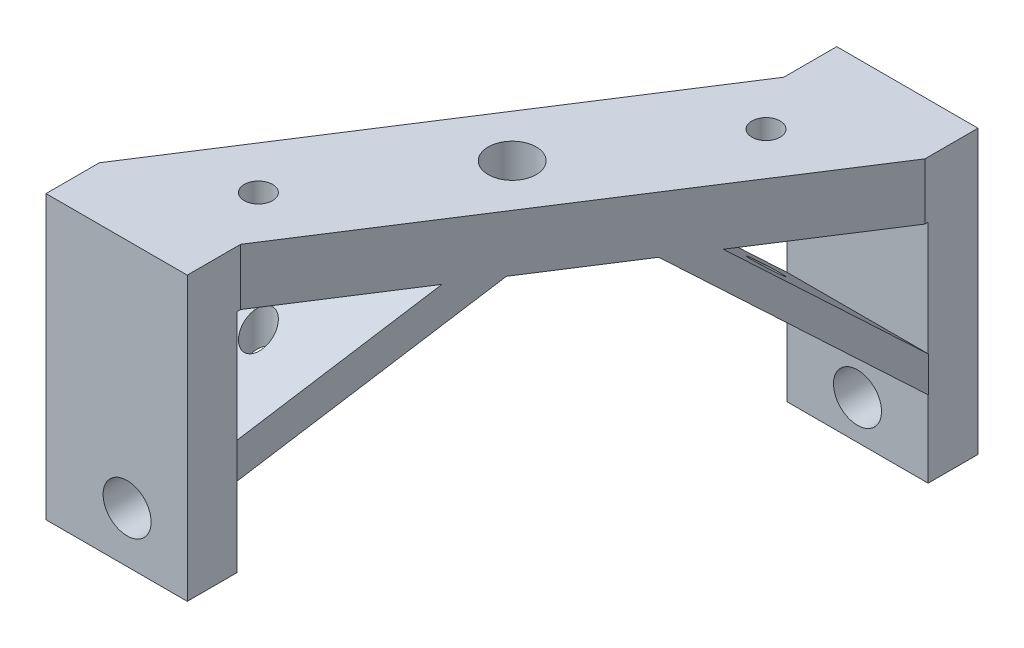
ISO-10303-21;
HEADER;
FILE_DESCRIPTION(('STEP AP214'),'2;1');
FILE_NAME('part.step','',(''),(''),'','','');
FILE_SCHEMA(('AUTOMOTIVE_DESIGN { 1 0 10303 214 1 1 1 1 }'));
ENDSEC;
DATA;
#1=APPLICATION_CONTEXT('core data for automotive mechanical design processes');
#2=APPLICATION_PROTOCOL_DEFINITION('international standard','automotive_design',2000,#1);
#3=PRODUCT_CONTEXT('',#1,'mechanical');
#4=PRODUCT('Part','Part','',(#3));
#5=PRODUCT_RELATED_PRODUCT_CATEGORY('part','',(#4));
#6=PRODUCT_DEFINITION_FORMATION('','',#4);
#7=PRODUCT_DEFINITION_CONTEXT('part definition',#1,'design');
#8=PRODUCT_DEFINITION('design','',#6,#7);
#9=PRODUCT_DEFINITION_SHAPE('','',#8);
#10=(LENGTH_UNIT() NAMED_UNIT(*) SI_UNIT(.MILLI.,.METRE.));
#11=(NAMED_UNIT(*) PLANE_ANGLE_UNIT() SI_UNIT($,.RADIAN.));
#12=(NAMED_UNIT(*) SI_UNIT($,.STERADIAN.) SOLID_ANGLE_UNIT());
#13=UNCERTAINTY_MEASURE_WITH_UNIT(LENGTH_MEASURE(1.E-05),#10,'distance_accuracy_value','');
#14=(GEOMETRIC_REPRESENTATION_CONTEXT(3) GLOBAL_UNCERTAINTY_ASSIGNED_CONTEXT((#13)) GLOBAL_UNIT_ASSIGNED_CONTEXT((#10,
#11,#12)) REPRESENTATION_CONTEXT('',''));
#15=CARTESIAN_POINT('',(0.,0.,0.));
#16=DIRECTION('',(0.,0.,1.));
#17=DIRECTION('',(1.,0.,0.));
#18=AXIS2_PLACEMENT_3D('',#15,#16,#17);
#19=CARTESIAN_POINT('',(-33.05,-4.00000000000001,0.));
#20=DIRECTION('',(0.,1.,0.));
#21=DIRECTION('',(0.,0.,1.));
#22=AXIS2_PLACEMENT_3D('',#19,#20,#21);
#23=PLANE('',#22);
#24=CARTESIAN_POINT('',(7.45330480302373,-4.00000000000001,-3.80222775707192));
#25=DIRECTION('',(0.,1.,0.));
#26=DIRECTION('',(0.,0.,1.));
#27=AXIS2_PLACEMENT_3D('',#24,#25,#26);
#28=CIRCLE('',#27,1.);
#29=CARTESIAN_POINT('',(7.45330480302373,-4.00000000000001,-2.80222775707191));
#30=VERTEX_POINT('',#29);
#31=EDGE_CURVE('E275',#30,#30,#28,.T.);
#32=ORIENTED_EDGE('',*,*,#31,.T.);
#33=EDGE_LOOP('',(#32));
#34=FACE_BOUND('',#33,.T.);
#35=DIRECTION('',(0.541539369461563,0.,-0.840675389983062));
#36=VECTOR('',#35,1.);
#37=CARTESIAN_POINT('',(18.9809548996278,-4.,-29.4656724189063));
#38=LINE('',#37,#36);
#39=CARTESIAN_POINT('',(0.,-4.00000000000001,0.));
#40=VERTEX_POINT('',#39);
#41=CARTESIAN_POINT('',(5.58186834052013,-4.00000000000001,-8.66518596545716));
#42=VERTEX_POINT('',#41);
#43=EDGE_CURVE('E249',#40,#42,#38,.T.);
#44=ORIENTED_EDGE('',*,*,#43,.T.);
#45=DIRECTION('',(-1.,0.,0.));
#46=VECTOR('',#45,1.);
#47=CARTESIAN_POINT('',(34.5923992558109,-4.00000000000001,-8.66518596545717));
#48=LINE('',#47,#46);
#49=CARTESIAN_POINT('',(15.5818683405201,-4.00000000000001,-8.66518596545717));
#50=VERTEX_POINT('',#49);
#51=EDGE_CURVE('E310',#50,#42,#48,.T.);
#52=ORIENTED_EDGE('',*,*,#51,.F.);
#53=DIRECTION('',(-0.541539369461563,0.,0.840675389983061));
#54=VECTOR('',#53,1.);
#55=CARTESIAN_POINT('',(10.,-4.00000000000001,0.));
#56=LINE('',#55,#54);
#57=CARTESIAN_POINT('',(10.,-4.,0.));
#58=VERTEX_POINT('',#57);
#59=EDGE_CURVE('E248',#50,#58,#56,.T.);
#60=ORIENTED_EDGE('',*,*,#59,.T.);
#61=DIRECTION('',(0.,0.,-1.));
#62=VECTOR('',#61,1.);
#63=CARTESIAN_POINT('',(10.,-4.,4.));
#64=LINE('',#63,#62);
#65=CARTESIAN_POINT('',(10.,-4.00000000000001,0.25));
#66=VERTEX_POINT('',#65);
#67=EDGE_CURVE('E225',#66,#58,#64,.T.);
#68=ORIENTED_EDGE('',*,*,#67,.F.);
#69=DIRECTION('',(1.,0.,0.));
#70=VECTOR('',#69,1.);
#71=CARTESIAN_POINT('',(0.,-4.00000000000001,0.25));
#72=LINE('',#71,#70);
#73=CARTESIAN_POINT('',(0.,-4.00000000000001,0.25));
#74=VERTEX_POINT('',#73);
#75=EDGE_CURVE('E207',#74,#66,#72,.T.);
#76=ORIENTED_EDGE('',*,*,#75,.F.);
#77=DIRECTION('',(0.,0.,-1.));
#78=VECTOR('',#77,1.);
#79=CARTESIAN_POINT('',(0.,-4.00000000000001,4.));
#80=LINE('',#79,#78);
#81=EDGE_CURVE('E228',#74,#40,#80,.T.);
#82=ORIENTED_EDGE('',*,*,#81,.T.);
#83=EDGE_LOOP('',(#44,#52,#60,#68,#76,#82));
#84=FACE_BOUND('',#83,.T.);
#85=ADVANCED_FACE('F34',(#34,#84),#23,.F.);
#86=CARTESIAN_POINT('',(14.4904774498139,-4.,-14.7328362094532));
#87=DIRECTION('',(0.,1.,0.));
#88=DIRECTION('',(0.,0.,1.));
#89=AXIS2_PLACEMENT_3D('',#86,#87,#88);
#90=CIRCLE('',#89,1.7);
#91=CARTESIAN_POINT('',(14.4904774498139,-4.,-13.0328362094532));
#92=VERTEX_POINT('',#91);
#93=EDGE_CURVE('E243',#92,#92,#90,.T.);
#94=ORIENTED_EDGE('',*,*,#93,.T.);
#95=EDGE_LOOP('',(#94));
#96=FACE_BOUND('',#95,.T.);
#97=CARTESIAN_POINT('',(21.5964039513119,-4.,-18.0020363503085));
#98=VERTEX_POINT('',#97);
#99=CARTESIAN_POINT('',(17.3708931836974,-4.00000000000001,-11.4424340152579));
#100=VERTEX_POINT('',#99);
#101=EDGE_CURVE('E247',#98,#100,#56,.T.);
#102=ORIENTED_EDGE('',*,*,#101,.T.);
#103=DIRECTION('',(-1.,0.,0.));
#104=VECTOR('',#103,1.);
#105=CARTESIAN_POINT('',(36.3814240989882,-4.,-11.4424340152579));
#106=LINE('',#105,#104);
#107=CARTESIAN_POINT('',(7.37089318369744,-4.00000000000001,-11.4424340152579));
#108=VERTEX_POINT('',#107);
#109=EDGE_CURVE('E319',#100,#108,#106,.T.);
#110=ORIENTED_EDGE('',*,*,#109,.T.);
#111=CARTESIAN_POINT('',(11.5964039513119,-4.,-18.0020363503085));
#112=VERTEX_POINT('',#111);
#113=EDGE_CURVE('E252',#108,#112,#38,.T.);
#114=ORIENTED_EDGE('',*,*,#113,.T.);
#115=DIRECTION('',(-1.,0.,0.));
#116=VECTOR('',#115,1.);
#117=CARTESIAN_POINT('',(40.6069348666027,-4.,-18.0020363503085));
#118=LINE('',#117,#116);
#119=EDGE_CURVE('E337',#98,#112,#118,.T.);
#120=ORIENTED_EDGE('',*,*,#119,.F.);
#121=EDGE_LOOP('',(#102,#110,#114,#120));
#122=FACE_BOUND('',#121,.T.);
#123=ADVANCED_FACE('F413',(#96,#122),#23,.F.);
#124=CARTESIAN_POINT('',(21.5333279339781,-4.,-25.6597871591787));
#125=DIRECTION('',(0.,1.,0.));
#126=DIRECTION('',(0.,0.,1.));
#127=AXIS2_PLACEMENT_3D('',#124,#125,#126);
#128=CIRCLE('',#127,1.);
#129=CARTESIAN_POINT('',(21.5333279339781,-4.,-24.6597871591787));
#130=VERTEX_POINT('',#129);
#131=EDGE_CURVE('E292',#130,#130,#128,.T.);
#132=ORIENTED_EDGE('',*,*,#131,.T.);
#133=EDGE_LOOP('',(#132));
#134=FACE_BOUND('',#133,.T.);
#135=CARTESIAN_POINT('',(28.9809548996278,-4.,-29.4656724189063));
#136=VERTEX_POINT('',#135);
#137=CARTESIAN_POINT('',(23.3854287944892,-4.,-20.7792844001093));
#138=VERTEX_POINT('',#137);
#139=EDGE_CURVE('E244',#136,#138,#56,.T.);
#140=ORIENTED_EDGE('',*,*,#139,.T.);
#141=DIRECTION('',(-1.,0.,0.));
#142=VECTOR('',#141,1.);
#143=CARTESIAN_POINT('',(42.3959597097801,-4.,-20.7792844001093));
#144=LINE('',#143,#142);
#145=CARTESIAN_POINT('',(13.3854287944892,-4.,-20.7792844001093));
#146=VERTEX_POINT('',#145);
#147=EDGE_CURVE('E345',#138,#146,#144,.T.);
#148=ORIENTED_EDGE('',*,*,#147,.T.);
#149=CARTESIAN_POINT('',(18.9809548996278,-4.,-29.4656724189063));
#150=VERTEX_POINT('',#149);
#151=EDGE_CURVE('E246',#146,#150,#38,.T.);
#152=ORIENTED_EDGE('',*,*,#151,.T.);
#153=DIRECTION('',(0.,0.,1.));
#154=VECTOR('',#153,1.);
#155=CARTESIAN_POINT('',(18.9809548996278,-4.,-33.4656724189063));
#156=LINE('',#155,#154);
#157=CARTESIAN_POINT('',(18.9809548996278,-4.,-29.6856724189063));
#158=VERTEX_POINT('',#157);
#159=EDGE_CURVE('E237',#158,#150,#156,.T.);
#160=ORIENTED_EDGE('',*,*,#159,.F.);
#161=DIRECTION('',(-1.,0.,0.));
#162=VECTOR('',#161,1.);
#163=CARTESIAN_POINT('',(18.9809548996278,-4.,-29.6856724189063));
#164=LINE('',#163,#162);
#165=CARTESIAN_POINT('',(28.9809548996278,-4.,-29.6856724189063));
#166=VERTEX_POINT('',#165);
#167=EDGE_CURVE('E194',#166,#158,#164,.T.);
#168=ORIENTED_EDGE('',*,*,#167,.F.);
#169=DIRECTION('',(0.,0.,1.));
#170=VECTOR('',#169,1.);
#171=CARTESIAN_POINT('',(28.9809548996278,-4.,-33.4656724189063));
#172=LINE('',#171,#170);
#173=EDGE_CURVE('E232',#166,#136,#172,.T.);
#174=ORIENTED_EDGE('',*,*,#173,.T.);
#175=EDGE_LOOP('',(#140,#148,#152,#160,#168,#174));
#176=FACE_BOUND('',#175,.T.);
#177=ADVANCED_FACE('F416',(#134,#176),#23,.F.);
#178=CARTESIAN_POINT('',(18.9809548996278,0.,-29.4656724189063));
#179=DIRECTION('',(-0.840675389983061,0.,-0.541539369461563));
#180=DIRECTION('',(-0.541539369461563,0.,0.840675389983062));
#181=AXIS2_PLACEMENT_3D('',#178,#179,#180);
#182=PLANE('',#181);
#183=ORIENTED_EDGE('',*,*,#43,.F.);
#184=DIRECTION('',(0.,-1.,0.));
#185=VECTOR('',#184,1.);
#186=CARTESIAN_POINT('',(0.,0.,0.));
#187=LINE('',#186,#185);
#188=CARTESIAN_POINT('',(0.,0.,0.));
#189=VERTEX_POINT('',#188);
#190=EDGE_CURVE('E251',#189,#40,#187,.T.);
#191=ORIENTED_EDGE('',*,*,#190,.F.);
#192=DIRECTION('',(-0.541539369461563,0.,0.840675389983061));
#193=VECTOR('',#192,1.);
#194=CARTESIAN_POINT('',(18.9809548996278,0.,-29.4656724189063));
#195=LINE('',#194,#193);
#196=CARTESIAN_POINT('',(18.9809548996278,0.,-29.4656724189063));
#197=VERTEX_POINT('',#196);
#198=EDGE_CURVE('E11',#197,#189,#195,.T.);
#199=ORIENTED_EDGE('',*,*,#198,.F.);
#200=DIRECTION('',(0.,-1.,0.));
#201=VECTOR('',#200,1.);
#202=CARTESIAN_POINT('',(18.9809548996278,0.,-29.4656724189063));
#203=LINE('',#202,#201);
#204=EDGE_CURVE('E253',#197,#150,#203,.T.);
#205=ORIENTED_EDGE('',*,*,#204,.T.);
#206=ORIENTED_EDGE('',*,*,#151,.F.);
#207=DIRECTION('',(0.431022047705189,-0.605401732152346,-0.669110407256504));
#208=VECTOR('',#207,1.);
#209=CARTESIAN_POINT('',(19.0811118401627,-12.,-29.6211541433974));
#210=LINE('',#209,#208);
#211=CARTESIAN_POINT('',(19.0811118401627,-12.,-29.6211541433974));
#212=VERTEX_POINT('',#211);
#213=EDGE_CURVE('E326',#146,#212,#210,.T.);
#214=ORIENTED_EDGE('',*,*,#213,.T.);
#215=DIRECTION('',(0.,-1.,0.));
#216=VECTOR('',#215,1.);
#217=CARTESIAN_POINT('',(19.0811118401627,-14.5128151673205,-29.6211541433974));
#218=LINE('',#217,#216);
#219=CARTESIAN_POINT('',(19.0811118401627,-14.5128151673205,-29.6211541433974));
#220=VERTEX_POINT('',#219);
#221=EDGE_CURVE('E325',#212,#220,#218,.T.);
#222=ORIENTED_EDGE('',*,*,#221,.T.);
#223=DIRECTION('',(-0.431022047705189,0.605401732152346,0.669110407256504));
#224=VECTOR('',#223,1.);
#225=CARTESIAN_POINT('',(11.5964039513119,-4.,-18.0020363503085));
#226=LINE('',#225,#224);
#227=EDGE_CURVE('E330',#220,#112,#226,.T.);
#228=ORIENTED_EDGE('',*,*,#227,.T.);
#229=ORIENTED_EDGE('',*,*,#113,.F.);
#230=DIRECTION('',(-0.431022047705186,-0.605401732152352,0.669110407256501));
#231=VECTOR('',#230,1.);
#232=CARTESIAN_POINT('',(7.37089318369744,-4.,-11.4424340152579));
#233=LINE('',#232,#231);
#234=CARTESIAN_POINT('',(-0.113814705153315,-14.5128151673205,0.176683777830793));
#235=VERTEX_POINT('',#234);
#236=EDGE_CURVE('E299',#108,#235,#233,.T.);
#237=ORIENTED_EDGE('',*,*,#236,.T.);
#238=DIRECTION('',(0.,1.,0.));
#239=VECTOR('',#238,1.);
#240=CARTESIAN_POINT('',(-0.113814705153315,-14.5128151673205,0.176683777830793));
#241=LINE('',#240,#239);
#242=CARTESIAN_POINT('',(-0.113814705153316,-12.,0.176683777830793));
#243=VERTEX_POINT('',#242);
#244=EDGE_CURVE('E298',#235,#243,#241,.T.);
#245=ORIENTED_EDGE('',*,*,#244,.T.);
#246=DIRECTION('',(0.431022047705186,0.605401732152352,-0.669110407256501));
#247=VECTOR('',#246,1.);
#248=CARTESIAN_POINT('',(-0.113814705153316,-12.,0.176683777830793));
#249=LINE('',#248,#247);
#250=EDGE_CURVE('E303',#243,#42,#249,.T.);
#251=ORIENTED_EDGE('',*,*,#250,.T.);
#252=EDGE_LOOP('',(#183,#191,#199,#205,#206,#214,#222,#228,#229,#237,#245,#251));
#253=FACE_BOUND('',#252,.T.);
#254=ADVANCED_FACE('F36',(#253),#182,.T.);
#255=CARTESIAN_POINT('',(18.9809548996278,0.,-29.4656724189063));
#256=DIRECTION('',(0.,1.,0.));
#257=DIRECTION('',(0.,0.,1.));
#258=AXIS2_PLACEMENT_3D('',#255,#256,#257);
#259=PLANE('',#258);
#260=DIRECTION('',(1.,0.,0.));
#261=VECTOR('',#260,1.);
#262=CARTESIAN_POINT('',(18.9809548996278,0.,-33.2156724189063));
#263=LINE('',#262,#261);
#264=CARTESIAN_POINT('',(18.9809548996278,0.,-33.2156724189063));
#265=VERTEX_POINT('',#264);
#266=CARTESIAN_POINT('',(28.9809548996278,0.,-33.2156724189063));
#267=VERTEX_POINT('',#266);
#268=EDGE_CURVE('E426',#265,#267,#263,.T.);
#269=ORIENTED_EDGE('',*,*,#268,.F.);
#270=DIRECTION('',(0.,0.,1.));
#271=VECTOR('',#270,1.);
#272=CARTESIAN_POINT('',(18.9809548996278,0.,-33.4656724189063));
#273=LINE('',#272,#271);
#274=EDGE_CURVE('E187',#265,#197,#273,.T.);
#275=ORIENTED_EDGE('',*,*,#274,.T.);
#276=ORIENTED_EDGE('',*,*,#198,.T.);
#277=DIRECTION('',(0.,0.,-1.));
#278=VECTOR('',#277,1.);
#279=CARTESIAN_POINT('',(0.,0.,4.));
#280=LINE('',#279,#278);
#281=CARTESIAN_POINT('',(0.,0.,3.78));
#282=VERTEX_POINT('',#281);
#283=EDGE_CURVE('E230',#282,#189,#280,.T.);
#284=ORIENTED_EDGE('',*,*,#283,.F.);
#285=DIRECTION('',(-1.,0.,0.));
#286=VECTOR('',#285,1.);
#287=CARTESIAN_POINT('',(18.9809548996278,0.,3.78));
#288=LINE('',#287,#286);
#289=CARTESIAN_POINT('',(10.,0.,3.78));
#290=VERTEX_POINT('',#289);
#291=EDGE_CURVE('E271',#290,#282,#288,.T.);
#292=ORIENTED_EDGE('',*,*,#291,.F.);
#293=DIRECTION('',(0.,0.,-1.));
#294=VECTOR('',#293,1.);
#295=CARTESIAN_POINT('',(10.,0.,4.));
#296=LINE('',#295,#294);
#297=CARTESIAN_POINT('',(10.,0.,0.));
#298=VERTEX_POINT('',#297);
#299=EDGE_CURVE('E223',#290,#298,#296,.T.);
#300=ORIENTED_EDGE('',*,*,#299,.T.);
#301=DIRECTION('',(-0.541539369461563,0.,0.840675389983061));
#302=VECTOR('',#301,1.);
#303=CARTESIAN_POINT('',(28.9809548996278,0.,-29.4656724189063));
#304=LINE('',#303,#302);
#305=CARTESIAN_POINT('',(28.9809548996278,0.,-29.4656724189063));
#306=VERTEX_POINT('',#305);
#307=EDGE_CURVE('E43',#306,#298,#304,.T.);
#308=ORIENTED_EDGE('',*,*,#307,.F.);
#309=DIRECTION('',(0.,0.,1.));
#310=VECTOR('',#309,1.);
#311=CARTESIAN_POINT('',(28.9809548996278,0.,-33.4656724189063));
#312=LINE('',#311,#310);
#313=EDGE_CURVE('E234',#267,#306,#312,.T.);
#314=ORIENTED_EDGE('',*,*,#313,.F.);
#315=EDGE_LOOP('',(#269,#275,#276,#284,#292,#300,#308,#314));
#316=FACE_BOUND('',#315,.T.);
#317=CARTESIAN_POINT('',(7.45330480302373,0.,-3.80222775707192));
#318=DIRECTION('',(0.,1.,0.));
#319=DIRECTION('',(0.,0.,1.));
#320=AXIS2_PLACEMENT_3D('',#317,#318,#319);
#321=CIRCLE('',#320,1.);
#322=CARTESIAN_POINT('',(7.45330480302373,0.,-2.80222775707191));
#323=VERTEX_POINT('',#322);
#324=EDGE_CURVE('E282',#323,#323,#321,.T.);
#325=ORIENTED_EDGE('',*,*,#324,.F.);
#326=EDGE_LOOP('',(#325));
#327=FACE_BOUND('',#326,.T.);
#328=CARTESIAN_POINT('',(21.5333279339781,0.,-25.6597871591787));
#329=DIRECTION('',(0.,1.,0.));
#330=DIRECTION('',(0.,0.,1.));
#331=AXIS2_PLACEMENT_3D('',#328,#329,#330);
#332=CIRCLE('',#331,1.);
#333=CARTESIAN_POINT('',(21.5333279339781,0.,-24.6597871591787));
#334=VERTEX_POINT('',#333);
#335=EDGE_CURVE('E279',#334,#334,#332,.T.);
#336=ORIENTED_EDGE('',*,*,#335,.F.);
#337=EDGE_LOOP('',(#336));
#338=FACE_BOUND('',#337,.T.);
#339=CARTESIAN_POINT('',(14.4904774498139,0.,-14.7328362094532));
#340=DIRECTION('',(0.,1.,0.));
#341=DIRECTION('',(0.,0.,1.));
#342=AXIS2_PLACEMENT_3D('',#339,#340,#341);
#343=CIRCLE('',#342,1.7);
#344=CARTESIAN_POINT('',(14.4904774498139,0.,-13.0328362094532));
#345=VERTEX_POINT('',#344);
#346=EDGE_CURVE('E240',#345,#345,#343,.T.);
#347=ORIENTED_EDGE('',*,*,#346,.F.);
#348=EDGE_LOOP('',(#347));
#349=FACE_BOUND('',#348,.T.);
#350=ADVANCED_FACE('F383',(#316,#327,#338,#349),#259,.T.);
#351=CARTESIAN_POINT('',(28.9809548996278,0.,-29.4656724189063));
#352=DIRECTION('',(0.840675389983061,0.,0.541539369461563));
#353=DIRECTION('',(0.541539369461563,0.,-0.840675389983062));
#354=AXIS2_PLACEMENT_3D('',#351,#352,#353);
#355=PLANE('',#354);
#356=ORIENTED_EDGE('',*,*,#139,.F.);
#357=DIRECTION('',(0.,1.,0.));
#358=VECTOR('',#357,1.);
#359=CARTESIAN_POINT('',(28.9809548996278,0.,-29.4656724189063));
#360=LINE('',#359,#358);
#361=EDGE_CURVE('E256',#136,#306,#360,.T.);
#362=ORIENTED_EDGE('',*,*,#361,.T.);
#363=ORIENTED_EDGE('',*,*,#307,.T.);
#364=DIRECTION('',(0.,1.,0.));
#365=VECTOR('',#364,1.);
#366=CARTESIAN_POINT('',(10.,0.,0.));
#367=LINE('',#366,#365);
#368=EDGE_CURVE('E257',#58,#298,#367,.T.);
#369=ORIENTED_EDGE('',*,*,#368,.F.);
#370=ORIENTED_EDGE('',*,*,#59,.F.);
#371=DIRECTION('',(0.431022047705186,0.605401732152352,-0.669110407256501));
#372=VECTOR('',#371,1.);
#373=CARTESIAN_POINT('',(13.4179618348999,-7.03936365597305,-5.30597877188253));
#374=LINE('',#373,#372);
#375=CARTESIAN_POINT('',(9.88618529484668,-12.,0.176683777830793));
#376=VERTEX_POINT('',#375);
#377=EDGE_CURVE('E302',#376,#50,#374,.T.);
#378=ORIENTED_EDGE('',*,*,#377,.F.);
#379=DIRECTION('',(0.,1.,0.));
#380=VECTOR('',#379,1.);
#381=CARTESIAN_POINT('',(9.88618529484669,-14.5128151673205,0.176683777830793));
#382=LINE('',#381,#380);
#383=CARTESIAN_POINT('',(9.88618529484668,-14.5128151673205,0.176683777830793));
#384=VERTEX_POINT('',#383);
#385=EDGE_CURVE('E311',#384,#376,#382,.T.);
#386=ORIENTED_EDGE('',*,*,#385,.F.);
#387=DIRECTION('',(-0.431022047705186,-0.605401732152352,0.669110407256501));
#388=VECTOR('',#387,1.);
#389=CARTESIAN_POINT('',(20.9026697237507,0.960636344026954,-16.9250965649713));
#390=LINE('',#389,#388);
#391=EDGE_CURVE('E316',#100,#384,#390,.T.);
#392=ORIENTED_EDGE('',*,*,#391,.F.);
#393=ORIENTED_EDGE('',*,*,#101,.F.);
#394=DIRECTION('',(-0.431022047705189,0.605401732152346,0.669110407256504));
#395=VECTOR('',#394,1.);
#396=CARTESIAN_POINT('',(25.1281804913652,-8.96063634402698,-23.4846989000219));
#397=LINE('',#396,#395);
#398=CARTESIAN_POINT('',(29.0811118401627,-14.5128151673205,-29.6211541433974));
#399=VERTEX_POINT('',#398);
#400=EDGE_CURVE('E329',#399,#98,#397,.T.);
#401=ORIENTED_EDGE('',*,*,#400,.F.);
#402=DIRECTION('',(0.,-1.,0.));
#403=VECTOR('',#402,1.);
#404=CARTESIAN_POINT('',(29.0811118401627,-14.5128151673205,-29.6211541433974));
#405=LINE('',#404,#403);
#406=CARTESIAN_POINT('',(29.0811118401627,-12.,-29.6211541433974));
#407=VERTEX_POINT('',#406);
#408=EDGE_CURVE('E338',#407,#399,#405,.T.);
#409=ORIENTED_EDGE('',*,*,#408,.F.);
#410=DIRECTION('',(0.431022047705189,-0.605401732152346,-0.669110407256504));
#411=VECTOR('',#410,1.);
#412=CARTESIAN_POINT('',(32.612888380216,-16.960636344027,-35.1038166931108));
#413=LINE('',#412,#411);
#414=EDGE_CURVE('E342',#138,#407,#413,.T.);
#415=ORIENTED_EDGE('',*,*,#414,.F.);
#416=EDGE_LOOP('',(#356,#362,#363,#369,#370,#378,#386,#392,#393,#401,#409,#415));
#417=FACE_BOUND('',#416,.T.);
#418=ADVANCED_FACE('F367',(#417),#355,.T.);
#419=CARTESIAN_POINT('',(14.4904774498139,-43.05,-14.7328362094532));
#420=DIRECTION('',(0.,1.,0.));
#421=DIRECTION('',(0.,0.,1.));
#422=AXIS2_PLACEMENT_3D('',#419,#420,#421);
#423=CYLINDRICAL_SURFACE('',#422,1.7);
#424=ORIENTED_EDGE('',*,*,#346,.T.);
#425=EDGE_LOOP('',(#424));
#426=FACE_BOUND('',#425,.T.);
#427=ORIENTED_EDGE('',*,*,#93,.F.);
#428=EDGE_LOOP('',(#427));
#429=FACE_BOUND('',#428,.T.);
#430=ADVANCED_FACE('F537',(#426,#429),#423,.F.);
#431=CARTESIAN_POINT('',(18.9809548996278,-4.,-33.4656724189063));
#432=DIRECTION('',(1.,0.,0.));
#433=DIRECTION('',(0.,1.,0.));
#434=AXIS2_PLACEMENT_3D('',#431,#432,#433);
#435=PLANE('',#434);
#436=ORIENTED_EDGE('',*,*,#274,.F.);
#437=DIRECTION('',(0.,1.,0.));
#438=VECTOR('',#437,1.);
#439=CARTESIAN_POINT('',(18.9809548996278,-20.,-33.2156724189063));
#440=LINE('',#439,#438);
#441=CARTESIAN_POINT('',(18.9809548996278,-20.,-33.2156724189063));
#442=VERTEX_POINT('',#441);
#443=EDGE_CURVE('E174',#442,#265,#440,.T.);
#444=ORIENTED_EDGE('',*,*,#443,.F.);
#445=DIRECTION('',(0.,0.,-1.));
#446=VECTOR('',#445,1.);
#447=CARTESIAN_POINT('',(18.9809548996278,-20.,-33.4656724189063));
#448=LINE('',#447,#446);
#449=CARTESIAN_POINT('',(18.9809548996278,-20.,-29.6856724189063));
#450=VERTEX_POINT('',#449);
#451=EDGE_CURVE('E185',#450,#442,#448,.T.);
#452=ORIENTED_EDGE('',*,*,#451,.F.);
#453=DIRECTION('',(0.,1.,0.));
#454=VECTOR('',#453,1.);
#455=CARTESIAN_POINT('',(18.9809548996278,-20.,-29.6856724189063));
#456=LINE('',#455,#454);
#457=EDGE_CURVE('E202',#450,#158,#456,.T.);
#458=ORIENTED_EDGE('',*,*,#457,.T.);
#459=ORIENTED_EDGE('',*,*,#159,.T.);
#460=ORIENTED_EDGE('',*,*,#204,.F.);
#461=EDGE_LOOP('',(#436,#444,#452,#458,#459,#460));
#462=FACE_BOUND('',#461,.T.);
#463=ADVANCED_FACE('F183',(#462),#435,.F.);
#464=CARTESIAN_POINT('',(28.9809548996278,0.,-33.4656724189063));
#465=DIRECTION('',(-1.,0.,0.));
#466=DIRECTION('',(0.,-1.,0.));
#467=AXIS2_PLACEMENT_3D('',#464,#465,#466);
#468=PLANE('',#467);
#469=DIRECTION('',(0.,0.,1.));
#470=VECTOR('',#469,1.);
#471=CARTESIAN_POINT('',(28.9809548996278,-20.,-33.4656724189063));
#472=LINE('',#471,#470);
#473=CARTESIAN_POINT('',(28.9809548996278,-20.,-33.2156724189063));
#474=VERTEX_POINT('',#473);
#475=CARTESIAN_POINT('',(28.9809548996278,-20.,-29.6856724189063));
#476=VERTEX_POINT('',#475);
#477=EDGE_CURVE('E193',#474,#476,#472,.T.);
#478=ORIENTED_EDGE('',*,*,#477,.F.);
#479=DIRECTION('',(0.,1.,0.));
#480=VECTOR('',#479,1.);
#481=CARTESIAN_POINT('',(28.9809548996278,-20.,-33.2156724189063));
#482=LINE('',#481,#480);
#483=EDGE_CURVE('E59',#474,#267,#482,.T.);
#484=ORIENTED_EDGE('',*,*,#483,.T.);
#485=ORIENTED_EDGE('',*,*,#313,.T.);
#486=ORIENTED_EDGE('',*,*,#361,.F.);
#487=ORIENTED_EDGE('',*,*,#173,.F.);
#488=DIRECTION('',(0.,1.,0.));
#489=VECTOR('',#488,1.);
#490=CARTESIAN_POINT('',(28.9809548996278,-20.,-29.6856724189063));
#491=LINE('',#490,#489);
#492=EDGE_CURVE('E205',#476,#166,#491,.T.);
#493=ORIENTED_EDGE('',*,*,#492,.F.);
#494=EDGE_LOOP('',(#478,#484,#485,#486,#487,#493));
#495=FACE_BOUND('',#494,.T.);
#496=ADVANCED_FACE('F423',(#495),#468,.F.);
#497=CARTESIAN_POINT('',(0.,0.,4.));
#498=DIRECTION('',(1.,0.,0.));
#499=DIRECTION('',(0.,0.,-1.));
#500=AXIS2_PLACEMENT_3D('',#497,#498,#499);
#501=PLANE('',#500);
#502=DIRECTION('',(0.,0.,-1.));
#503=VECTOR('',#502,1.);
#504=CARTESIAN_POINT('',(0.,-20.,4.));
#505=LINE('',#504,#503);
#506=CARTESIAN_POINT('',(0.,-20.,3.78));
#507=VERTEX_POINT('',#506);
#508=CARTESIAN_POINT('',(0.,-20.,0.249999999999996));
#509=VERTEX_POINT('',#508);
#510=EDGE_CURVE('E208',#507,#509,#505,.T.);
#511=ORIENTED_EDGE('',*,*,#510,.F.);
#512=DIRECTION('',(0.,1.,0.));
#513=VECTOR('',#512,1.);
#514=CARTESIAN_POINT('',(0.,-20.,3.78));
#515=LINE('',#514,#513);
#516=EDGE_CURVE('E51',#507,#282,#515,.T.);
#517=ORIENTED_EDGE('',*,*,#516,.T.);
#518=ORIENTED_EDGE('',*,*,#283,.T.);
#519=ORIENTED_EDGE('',*,*,#190,.T.);
#520=ORIENTED_EDGE('',*,*,#81,.F.);
#521=DIRECTION('',(0.,1.,0.));
#522=VECTOR('',#521,1.);
#523=CARTESIAN_POINT('',(0.,-20.,0.249999999999996));
#524=LINE('',#523,#522);
#525=EDGE_CURVE('E220',#509,#74,#524,.T.);
#526=ORIENTED_EDGE('',*,*,#525,.F.);
#527=EDGE_LOOP('',(#511,#517,#518,#519,#520,#526));
#528=FACE_BOUND('',#527,.T.);
#529=ADVANCED_FACE('F400',(#528),#501,.F.);
#530=CARTESIAN_POINT('',(10.,-4.,4.));
#531=DIRECTION('',(-1.,0.,0.));
#532=DIRECTION('',(0.,-1.,0.));
#533=AXIS2_PLACEMENT_3D('',#530,#531,#532);
#534=PLANE('',#533);
#535=ORIENTED_EDGE('',*,*,#299,.F.);
#536=DIRECTION('',(0.,1.,0.));
#537=VECTOR('',#536,1.);
#538=CARTESIAN_POINT('',(10.,-20.,3.78));
#539=LINE('',#538,#537);
#540=CARTESIAN_POINT('',(10.,-20.,3.78));
#541=VERTEX_POINT('',#540);
#542=EDGE_CURVE('E388',#541,#290,#539,.T.);
#543=ORIENTED_EDGE('',*,*,#542,.F.);
#544=DIRECTION('',(0.,0.,1.));
#545=VECTOR('',#544,1.);
#546=CARTESIAN_POINT('',(10.,-20.,4.));
#547=LINE('',#546,#545);
#548=CARTESIAN_POINT('',(10.,-20.,0.249999999999996));
#549=VERTEX_POINT('',#548);
#550=EDGE_CURVE('E212',#549,#541,#547,.T.);
#551=ORIENTED_EDGE('',*,*,#550,.F.);
#552=DIRECTION('',(0.,1.,0.));
#553=VECTOR('',#552,1.);
#554=CARTESIAN_POINT('',(10.,-20.,0.249999999999996));
#555=LINE('',#554,#553);
#556=EDGE_CURVE('E215',#549,#66,#555,.T.);
#557=ORIENTED_EDGE('',*,*,#556,.T.);
#558=ORIENTED_EDGE('',*,*,#67,.T.);
#559=ORIENTED_EDGE('',*,*,#368,.T.);
#560=EDGE_LOOP('',(#535,#543,#551,#557,#558,#559));
#561=FACE_BOUND('',#560,.T.);
#562=ADVANCED_FACE('F376',(#561),#534,.F.);
#563=CARTESIAN_POINT('',(0.,-20.,0.249999999999996));
#564=DIRECTION('',(0.,0.,1.));
#565=DIRECTION('',(0.,-1.,0.));
#566=AXIS2_PLACEMENT_3D('',#563,#564,#565);
#567=PLANE('',#566);
#568=CARTESIAN_POINT('',(5.7417085882519,-16.4174799308276,0.249999999999998));
#569=DIRECTION('',(0.,0.,1.));
#570=DIRECTION('',(0.,-1.,0.));
#571=AXIS2_PLACEMENT_3D('',#568,#569,#570);
#572=CIRCLE('',#571,1.7);
#573=CARTESIAN_POINT('',(5.7417085882519,-18.1174799308276,0.249999999999997));
#574=VERTEX_POINT('',#573);
#575=EDGE_CURVE('E430',#574,#574,#572,.T.);
#576=ORIENTED_EDGE('',*,*,#575,.T.);
#577=EDGE_LOOP('',(#576));
#578=FACE_BOUND('',#577,.T.);
#579=ORIENTED_EDGE('',*,*,#75,.T.);
#580=ORIENTED_EDGE('',*,*,#556,.F.);
#581=DIRECTION('',(1.,0.,0.));
#582=VECTOR('',#581,1.);
#583=CARTESIAN_POINT('',(0.,-20.,0.249999999999996));
#584=LINE('',#583,#582);
#585=EDGE_CURVE('E210',#509,#549,#584,.T.);
#586=ORIENTED_EDGE('',*,*,#585,.F.);
#587=ORIENTED_EDGE('',*,*,#525,.T.);
#588=EDGE_LOOP('',(#579,#580,#586,#587));
#589=FACE_BOUND('',#588,.T.);
#590=ADVANCED_FACE('F397',(#578,#589),#567,.F.);
#591=CARTESIAN_POINT('',(0.,-20.,0.));
#592=DIRECTION('',(0.,-1.,0.));
#593=DIRECTION('',(0.,0.,-1.));
#594=AXIS2_PLACEMENT_3D('',#591,#592,#593);
#595=PLANE('',#594);
#596=DIRECTION('',(-1.,0.,0.));
#597=VECTOR('',#596,1.);
#598=CARTESIAN_POINT('',(10.,-20.,3.78));
#599=LINE('',#598,#597);
#600=EDGE_CURVE('E389',#541,#507,#599,.T.);
#601=ORIENTED_EDGE('',*,*,#600,.T.);
#602=ORIENTED_EDGE('',*,*,#510,.T.);
#603=ORIENTED_EDGE('',*,*,#585,.T.);
#604=ORIENTED_EDGE('',*,*,#550,.T.);
#605=EDGE_LOOP('',(#601,#602,#603,#604));
#606=FACE_BOUND('',#605,.T.);
#607=ADVANCED_FACE('F392',(#606),#595,.T.);
#608=CARTESIAN_POINT('',(18.9809548996278,-20.,-29.6856724189063));
#609=DIRECTION('',(0.,0.,-1.));
#610=DIRECTION('',(0.,1.,0.));
#611=AXIS2_PLACEMENT_3D('',#608,#609,#610);
#612=PLANE('',#611);
#613=CARTESIAN_POINT('',(23.9809548996278,-17.25,-29.6856724189063));
#614=DIRECTION('',(0.,0.,1.));
#615=DIRECTION('',(1.,0.,0.));
#616=AXIS2_PLACEMENT_3D('',#613,#614,#615);
#617=CIRCLE('',#616,1.7);
#618=CARTESIAN_POINT('',(25.6809548996278,-17.25,-29.6856724189063));
#619=VERTEX_POINT('',#618);
#620=EDGE_CURVE('E295',#619,#619,#617,.T.);
#621=ORIENTED_EDGE('',*,*,#620,.F.);
#622=EDGE_LOOP('',(#621));
#623=FACE_BOUND('',#622,.T.);
#624=ORIENTED_EDGE('',*,*,#167,.T.);
#625=ORIENTED_EDGE('',*,*,#457,.F.);
#626=DIRECTION('',(-1.,0.,0.));
#627=VECTOR('',#626,1.);
#628=CARTESIAN_POINT('',(18.9809548996278,-20.,-29.6856724189063));
#629=LINE('',#628,#627);
#630=EDGE_CURVE('E191',#476,#450,#629,.T.);
#631=ORIENTED_EDGE('',*,*,#630,.F.);
#632=ORIENTED_EDGE('',*,*,#492,.T.);
#633=EDGE_LOOP('',(#624,#625,#631,#632));
#634=FACE_BOUND('',#633,.T.);
#635=ADVANCED_FACE('F419',(#623,#634),#612,.F.);
#636=CARTESIAN_POINT('',(0.,-20.,0.));
#637=DIRECTION('',(0.,1.,0.));
#638=DIRECTION('',(0.,0.,1.));
#639=AXIS2_PLACEMENT_3D('',#636,#637,#638);
#640=PLANE('',#639);
#641=ORIENTED_EDGE('',*,*,#451,.T.);
#642=DIRECTION('',(1.,0.,0.));
#643=VECTOR('',#642,1.);
#644=CARTESIAN_POINT('',(28.9809548996278,-20.,-33.2156724189063));
#645=LINE('',#644,#643);
#646=EDGE_CURVE('E170',#442,#474,#645,.T.);
#647=ORIENTED_EDGE('',*,*,#646,.T.);
#648=ORIENTED_EDGE('',*,*,#477,.T.);
#649=ORIENTED_EDGE('',*,*,#630,.T.);
#650=EDGE_LOOP('',(#641,#647,#648,#649));
#651=FACE_BOUND('',#650,.T.);
#652=ADVANCED_FACE('F189',(#651),#640,.F.);
#653=CARTESIAN_POINT('',(40.6069348666027,-4.,-18.0020363503085));
#654=DIRECTION('',(0.,-0.741526888210835,0.670923150636759));
#655=DIRECTION('',(0.,-0.670923150636759,-0.741526888210835));
#656=AXIS2_PLACEMENT_3D('',#653,#654,#655);
#657=PLANE('',#656);
#658=CARTESIAN_POINT('',(21.5333279339781,-10.9286257601189,-25.6597871591787));
#659=DIRECTION('',(0.,-0.741526888210835,0.670923150636759));
#660=DIRECTION('',(0.,0.670923150636759,0.741526888210835));
#661=AXIS2_PLACEMENT_3D('',#658,#659,#660);
#662=ELLIPSE('',#661,1.34856876520393,1.);
#663=CARTESIAN_POINT('',(21.5333279339781,-10.0238397553179,-24.6597871591787));
#664=VERTEX_POINT('',#663);
#665=EDGE_CURVE('E274',#664,#664,#662,.T.);
#666=ORIENTED_EDGE('',*,*,#665,.F.);
#667=EDGE_LOOP('',(#666));
#668=FACE_BOUND('',#667,.T.);
#669=DIRECTION('',(-1.,0.,0.));
#670=VECTOR('',#669,1.);
#671=CARTESIAN_POINT('',(48.0916427554536,-14.5128151673205,-29.6211541433974));
#672=LINE('',#671,#670);
#673=EDGE_CURVE('E197',#399,#220,#672,.T.);
#674=ORIENTED_EDGE('',*,*,#673,.F.);
#675=ORIENTED_EDGE('',*,*,#400,.T.);
#676=ORIENTED_EDGE('',*,*,#119,.T.);
#677=ORIENTED_EDGE('',*,*,#227,.F.);
#678=EDGE_LOOP('',(#674,#675,#676,#677));
#679=FACE_BOUND('',#678,.T.);
#680=ADVANCED_FACE('F352',(#668,#679),#657,.T.);
#681=CARTESIAN_POINT('',(48.0916427554536,-12.,-29.6211541433974));
#682=DIRECTION('',(0.,0.741526888210836,-0.670923150636759));
#683=DIRECTION('',(0.,0.670923150636759,0.741526888210836));
#684=AXIS2_PLACEMENT_3D('',#681,#682,#683);
#685=PLANE('',#684);
#686=CARTESIAN_POINT('',(21.5333279339781,-8.41581059279841,-25.6597871591787));
#687=DIRECTION('',(0.,0.741526888210836,-0.670923150636759));
#688=DIRECTION('',(0.,0.670923150636759,0.741526888210836));
#689=AXIS2_PLACEMENT_3D('',#686,#687,#688);
#690=ELLIPSE('',#689,1.34856876520393,1.);
#691=CARTESIAN_POINT('',(21.5333279339781,-7.51102458799746,-24.6597871591787));
#692=VERTEX_POINT('',#691);
#693=EDGE_CURVE('E272',#692,#692,#690,.T.);
#694=ORIENTED_EDGE('',*,*,#693,.F.);
#695=EDGE_LOOP('',(#694));
#696=FACE_BOUND('',#695,.T.);
#697=ORIENTED_EDGE('',*,*,#147,.F.);
#698=ORIENTED_EDGE('',*,*,#414,.T.);
#699=DIRECTION('',(-1.,0.,0.));
#700=VECTOR('',#699,1.);
#701=CARTESIAN_POINT('',(48.0916427554536,-12.,-29.6211541433974));
#702=LINE('',#701,#700);
#703=EDGE_CURVE('E341',#407,#212,#702,.T.);
#704=ORIENTED_EDGE('',*,*,#703,.T.);
#705=ORIENTED_EDGE('',*,*,#213,.F.);
#706=EDGE_LOOP('',(#697,#698,#704,#705));
#707=FACE_BOUND('',#706,.T.);
#708=ADVANCED_FACE('F447',(#696,#707),#685,.T.);
#709=CARTESIAN_POINT('',(48.0916427554536,-14.5128151673205,-29.6211541433974));
#710=DIRECTION('',(0.,0.,-1.));
#711=DIRECTION('',(-1.,0.,0.));
#712=AXIS2_PLACEMENT_3D('',#709,#710,#711);
#713=PLANE('',#712);
#714=ORIENTED_EDGE('',*,*,#703,.F.);
#715=ORIENTED_EDGE('',*,*,#408,.T.);
#716=ORIENTED_EDGE('',*,*,#673,.T.);
#717=ORIENTED_EDGE('',*,*,#221,.F.);
#718=EDGE_LOOP('',(#714,#715,#716,#717));
#719=FACE_BOUND('',#718,.T.);
#720=ADVANCED_FACE('F363',(#719),#713,.T.);
#721=CARTESIAN_POINT('',(28.8967162101374,-12.,0.176683777830793));
#722=DIRECTION('',(0.,0.74152688821083,0.670923150636765));
#723=DIRECTION('',(0.,-0.670923150636765,0.74152688821083));
#724=AXIS2_PLACEMENT_3D('',#721,#722,#723);
#725=PLANE('',#724);
#726=CARTESIAN_POINT('',(7.45330480302373,-8.39993652887894,-3.80222775707192));
#727=DIRECTION('',(0.,0.74152688821083,0.670923150636765));
#728=DIRECTION('',(0.,0.670923150636765,-0.74152688821083));
#729=AXIS2_PLACEMENT_3D('',#726,#727,#728);
#730=ELLIPSE('',#729,1.34856876520394,1.);
#731=CARTESIAN_POINT('',(7.45330480302373,-7.49515052407797,-4.80222775707192));
#732=VERTEX_POINT('',#731);
#733=EDGE_CURVE('E270',#732,#732,#730,.T.);
#734=ORIENTED_EDGE('',*,*,#733,.F.);
#735=EDGE_LOOP('',(#734));
#736=FACE_BOUND('',#735,.T.);
#737=DIRECTION('',(-1.,0.,0.));
#738=VECTOR('',#737,1.);
#739=CARTESIAN_POINT('',(28.8967162101374,-12.,0.176683777830793));
#740=LINE('',#739,#738);
#741=EDGE_CURVE('E314',#376,#243,#740,.T.);
#742=ORIENTED_EDGE('',*,*,#741,.F.);
#743=ORIENTED_EDGE('',*,*,#377,.T.);
#744=ORIENTED_EDGE('',*,*,#51,.T.);
#745=ORIENTED_EDGE('',*,*,#250,.F.);
#746=EDGE_LOOP('',(#742,#743,#744,#745));
#747=FACE_BOUND('',#746,.T.);
#748=ADVANCED_FACE('F406',(#736,#747),#725,.T.);
#749=CARTESIAN_POINT('',(36.3814240989882,-4.,-11.4424340152579));
#750=DIRECTION('',(0.,-0.74152688821083,-0.670923150636765));
#751=DIRECTION('',(0.,0.670923150636765,-0.74152688821083));
#752=AXIS2_PLACEMENT_3D('',#749,#750,#751);
#753=PLANE('',#752);
#754=CARTESIAN_POINT('',(7.45330480302373,-10.9127516961994,-3.80222775707192));
#755=DIRECTION('',(0.,-0.74152688821083,-0.670923150636765));
#756=DIRECTION('',(0.,0.670923150636765,-0.74152688821083));
#757=AXIS2_PLACEMENT_3D('',#754,#755,#756);
#758=ELLIPSE('',#757,1.34856876520394,1.);
#759=CARTESIAN_POINT('',(7.45330480302373,-10.0079656913985,-4.80222775707192));
#760=VERTEX_POINT('',#759);
#761=EDGE_CURVE('E268',#760,#760,#758,.T.);
#762=ORIENTED_EDGE('',*,*,#761,.F.);
#763=EDGE_LOOP('',(#762));
#764=FACE_BOUND('',#763,.T.);
#765=ORIENTED_EDGE('',*,*,#109,.F.);
#766=ORIENTED_EDGE('',*,*,#391,.T.);
#767=DIRECTION('',(-1.,0.,0.));
#768=VECTOR('',#767,1.);
#769=CARTESIAN_POINT('',(28.8967162101374,-14.5128151673205,0.176683777830793));
#770=LINE('',#769,#768);
#771=EDGE_CURVE('E315',#384,#235,#770,.T.);
#772=ORIENTED_EDGE('',*,*,#771,.T.);
#773=ORIENTED_EDGE('',*,*,#236,.F.);
#774=EDGE_LOOP('',(#765,#766,#772,#773));
#775=FACE_BOUND('',#774,.T.);
#776=ADVANCED_FACE('F412',(#764,#775),#753,.T.);
#777=CARTESIAN_POINT('',(28.8967162101374,-14.5128151673205,0.176683777830793));
#778=DIRECTION('',(0.,0.,1.));
#779=DIRECTION('',(1.,0.,0.));
#780=AXIS2_PLACEMENT_3D('',#777,#778,#779);
#781=PLANE('',#780);
#782=ORIENTED_EDGE('',*,*,#771,.F.);
#783=ORIENTED_EDGE('',*,*,#385,.T.);
#784=ORIENTED_EDGE('',*,*,#741,.T.);
#785=ORIENTED_EDGE('',*,*,#244,.F.);
#786=EDGE_LOOP('',(#782,#783,#784,#785));
#787=FACE_BOUND('',#786,.T.);
#788=ADVANCED_FACE('F409',(#787),#781,.T.);
#789=CARTESIAN_POINT('',(23.9809548996278,-17.25,-33.6856724189063));
#790=DIRECTION('',(0.,0.,1.));
#791=DIRECTION('',(1.,0.,0.));
#792=AXIS2_PLACEMENT_3D('',#789,#790,#791);
#793=CYLINDRICAL_SURFACE('',#792,1.7);
#794=CARTESIAN_POINT('',(23.9809548996278,-17.25,-33.2156724189063));
#795=DIRECTION('',(0.,0.,1.));
#796=DIRECTION('',(1.,0.,0.));
#797=AXIS2_PLACEMENT_3D('',#794,#795,#796);
#798=CIRCLE('',#797,1.7);
#799=CARTESIAN_POINT('',(25.6809548996278,-17.25,-33.2156724189063));
#800=VERTEX_POINT('',#799);
#801=EDGE_CURVE('E38',#800,#800,#798,.F.);
#802=ORIENTED_EDGE('',*,*,#801,.T.);
#803=EDGE_LOOP('',(#802));
#804=FACE_BOUND('',#803,.T.);
#805=ORIENTED_EDGE('',*,*,#620,.T.);
#806=EDGE_LOOP('',(#805));
#807=FACE_BOUND('',#806,.T.);
#808=ADVANCED_FACE('F479',(#804,#807),#793,.F.);
#809=CARTESIAN_POINT('',(7.45330480302373,-20.,-3.80222775707192));
#810=DIRECTION('',(0.,1.,0.));
#811=DIRECTION('',(0.,0.,1.));
#812=AXIS2_PLACEMENT_3D('',#809,#810,#811);
#813=CYLINDRICAL_SURFACE('',#812,1.);
#814=ORIENTED_EDGE('',*,*,#733,.T.);
#815=EDGE_LOOP('',(#814));
#816=FACE_BOUND('',#815,.T.);
#817=ORIENTED_EDGE('',*,*,#761,.T.);
#818=EDGE_LOOP('',(#817));
#819=FACE_BOUND('',#818,.T.);
#820=ADVANCED_FACE('F436',(#816,#819),#813,.F.);
#821=CARTESIAN_POINT('',(21.5333279339781,-20.,-25.6597871591787));
#822=DIRECTION('',(0.,1.,0.));
#823=DIRECTION('',(0.,0.,1.));
#824=AXIS2_PLACEMENT_3D('',#821,#822,#823);
#825=CYLINDRICAL_SURFACE('',#824,1.);
#826=ORIENTED_EDGE('',*,*,#665,.T.);
#827=EDGE_LOOP('',(#826));
#828=FACE_BOUND('',#827,.T.);
#829=ORIENTED_EDGE('',*,*,#693,.T.);
#830=EDGE_LOOP('',(#829));
#831=FACE_BOUND('',#830,.T.);
#832=ADVANCED_FACE('F467',(#828,#831),#825,.F.);
#833=CARTESIAN_POINT('',(21.5333279339781,0.,-24.6597871591787));
#834=CARTESIAN_POINT('',(21.5333279339781,-0.0416666666666667,-24.6597871591787));
#835=CARTESIAN_POINT('',(21.5333279339781,-0.0833333333333334,-24.6597871591787));
#836=CARTESIAN_POINT('',(21.5333279339781,-0.166666666666667,-24.6597871591787));
#837=CARTESIAN_POINT('',(21.5333279339781,-0.208333333333334,-24.6597871591787));
#838=CARTESIAN_POINT('',(21.5333279339781,-0.291666666666667,-24.6597871591787));
#839=CARTESIAN_POINT('',(21.5333279339781,-0.333333333333334,-24.6597871591787));
#840=CARTESIAN_POINT('',(21.5333279339781,-0.416666666666667,-24.6597871591787));
#841=CARTESIAN_POINT('',(21.5333279339781,-0.458333333333334,-24.6597871591787));
#842=CARTESIAN_POINT('',(21.5333279339781,-0.541666666666667,-24.6597871591787));
#843=CARTESIAN_POINT('',(21.5333279339781,-0.583333333333334,-24.6597871591787));
#844=CARTESIAN_POINT('',(21.5333279339781,-0.666666666666667,-24.6597871591787));
#845=CARTESIAN_POINT('',(21.5333279339781,-0.708333333333334,-24.6597871591787));
#846=CARTESIAN_POINT('',(21.5333279339781,-0.791666666666667,-24.6597871591787));
#847=CARTESIAN_POINT('',(21.5333279339781,-0.833333333333334,-24.6597871591787));
#848=CARTESIAN_POINT('',(21.5333279339781,-0.916666666666668,-24.6597871591787));
#849=CARTESIAN_POINT('',(21.5333279339781,-0.958333333333334,-24.6597871591787));
#850=CARTESIAN_POINT('',(21.5333279339781,-1.04166666666667,-24.6597871591787));
#851=CARTESIAN_POINT('',(21.5333279339781,-1.08333333333333,-24.6597871591787));
#852=CARTESIAN_POINT('',(21.5333279339781,-1.16666666666667,-24.6597871591787));
#853=CARTESIAN_POINT('',(21.5333279339781,-1.20833333333333,-24.6597871591787));
#854=CARTESIAN_POINT('',(21.5333279339781,-1.29166666666667,-24.6597871591787));
#855=CARTESIAN_POINT('',(21.5333279339781,-1.33333333333333,-24.6597871591787));
#856=CARTESIAN_POINT('',(21.5333279339781,-1.41666666666667,-24.6597871591787));
#857=CARTESIAN_POINT('',(21.5333279339781,-1.45833333333333,-24.6597871591787));
#858=CARTESIAN_POINT('',(21.5333279339781,-1.54166666666667,-24.6597871591787));
#859=CARTESIAN_POINT('',(21.5333279339781,-1.58333333333333,-24.6597871591787));
#860=CARTESIAN_POINT('',(21.5333279339781,-1.66666666666667,-24.6597871591787));
#861=CARTESIAN_POINT('',(21.5333279339781,-1.70833333333333,-24.6597871591787));
#862=CARTESIAN_POINT('',(21.5333279339781,-1.79166666666667,-24.6597871591787));
#863=CARTESIAN_POINT('',(21.5333279339781,-1.83333333333334,-24.6597871591787));
#864=CARTESIAN_POINT('',(21.5333279339781,-1.91666666666667,-24.6597871591787));
#865=CARTESIAN_POINT('',(21.5333279339781,-1.95833333333334,-24.6597871591787));
#866=CARTESIAN_POINT('',(21.5333279339781,-2.04166666666667,-24.6597871591787));
#867=CARTESIAN_POINT('',(21.5333279339781,-2.08333333333334,-24.6597871591787));
#868=CARTESIAN_POINT('',(21.5333279339781,-2.16666666666667,-24.6597871591787));
#869=CARTESIAN_POINT('',(21.5333279339781,-2.20833333333334,-24.6597871591787));
#870=CARTESIAN_POINT('',(21.5333279339781,-2.29166666666667,-24.6597871591787));
#871=CARTESIAN_POINT('',(21.5333279339781,-2.33333333333334,-24.6597871591787));
#872=CARTESIAN_POINT('',(21.5333279339781,-2.41666666666667,-24.6597871591787));
#873=CARTESIAN_POINT('',(21.5333279339781,-2.45833333333334,-24.6597871591787));
#874=CARTESIAN_POINT('',(21.5333279339781,-2.54166666666667,-24.6597871591787));
#875=CARTESIAN_POINT('',(21.5333279339781,-2.58333333333334,-24.6597871591787));
#876=CARTESIAN_POINT('',(21.5333279339781,-2.66666666666667,-24.6597871591787));
#877=CARTESIAN_POINT('',(21.5333279339781,-2.70833333333334,-24.6597871591787));
#878=CARTESIAN_POINT('',(21.5333279339781,-2.79166666666667,-24.6597871591787));
#879=CARTESIAN_POINT('',(21.5333279339781,-2.83333333333334,-24.6597871591787));
#880=CARTESIAN_POINT('',(21.5333279339781,-2.91666666666667,-24.6597871591787));
#881=CARTESIAN_POINT('',(21.5333279339781,-2.95833333333334,-24.6597871591787));
#882=CARTESIAN_POINT('',(21.5333279339781,-3.04166666666667,-24.6597871591787));
#883=CARTESIAN_POINT('',(21.5333279339781,-3.08333333333334,-24.6597871591787));
#884=CARTESIAN_POINT('',(21.5333279339781,-3.16666666666667,-24.6597871591787));
#885=CARTESIAN_POINT('',(21.5333279339781,-3.20833333333334,-24.6597871591787));
#886=CARTESIAN_POINT('',(21.5333279339781,-3.29166666666667,-24.6597871591787));
#887=CARTESIAN_POINT('',(21.5333279339781,-3.33333333333334,-24.6597871591787));
#888=CARTESIAN_POINT('',(21.5333279339781,-3.41666666666667,-24.6597871591787));
#889=CARTESIAN_POINT('',(21.5333279339781,-3.45833333333334,-24.6597871591787));
#890=CARTESIAN_POINT('',(21.5333279339781,-3.54166666666667,-24.6597871591787));
#891=CARTESIAN_POINT('',(21.5333279339781,-3.58333333333334,-24.6597871591787));
#892=CARTESIAN_POINT('',(21.5333279339781,-3.66666666666667,-24.6597871591787));
#893=CARTESIAN_POINT('',(21.5333279339781,-3.70833333333334,-24.6597871591787));
#894=CARTESIAN_POINT('',(21.5333279339781,-3.79166666666667,-24.6597871591787));
#895=CARTESIAN_POINT('',(21.5333279339781,-3.83333333333334,-24.6597871591787));
#896=CARTESIAN_POINT('',(21.5333279339781,-3.91666666666667,-24.6597871591787));
#897=CARTESIAN_POINT('',(21.5333279339781,-3.95833333333334,-24.6597871591787));
#898=CARTESIAN_POINT('',(21.5333279339781,-4.,-24.6597871591787));
#899=B_SPLINE_CURVE_WITH_KNOTS('',3,(#833,#834,#835,#836,#837,#838,#839,#840,#841,#842,#843,
#844,#845,#846,#847,#848,#849,#850,#851,#852,#853,#854,#855,#856,#857,#858,#859,#860,#861,#862,
#863,#864,#865,#866,#867,#868,#869,#870,#871,#872,#873,#874,#875,#876,#877,#878,#879,#880,#881,
#882,#883,#884,#885,#886,#887,#888,#889,#890,#891,#892,#893,#894,#895,#896,#897,#898),
.UNSPECIFIED.,.F.,.F.,(4,2,2,2,2,2,2,2,2,2,2,2,2,2,2,2,2,2,2,2,2,2,2,2,2,2,2,2,2,2,2,2,4),(0.,
0.125,0.25,0.375,0.5,0.625000000000001,0.750000000000001,0.875000000000001,1.,1.125,1.25,1.375,
1.5,1.625,1.75,1.875,2.,2.125,2.25,2.375,2.5,2.625,2.75,2.875,3.,3.125,3.25,3.375,3.5,3.625,
3.75,3.875,4.),.UNSPECIFIED.);
#900=EDGE_CURVE('BSEAM464',#334,#130,#899,.T.);
#901=ORIENTED_EDGE('',*,*,#335,.T.);
#902=ORIENTED_EDGE('',*,*,#131,.F.);
#903=ORIENTED_EDGE('',*,*,#900,.T.);
#904=ORIENTED_EDGE('',*,*,#900,.F.);
#905=EDGE_LOOP('',(#901,#903,#902,#904));
#906=FACE_BOUND('',#905,.T.);
#907=ADVANCED_FACE('F464',(#906),#825,.F.);
#908=CARTESIAN_POINT('',(7.45330480302373,0.,-2.80222775707191));
#909=CARTESIAN_POINT('',(7.45330480302373,-0.0416666666666667,-2.80222775707191));
#910=CARTESIAN_POINT('',(7.45330480302373,-0.0833333333333334,-2.80222775707191));
#911=CARTESIAN_POINT('',(7.45330480302373,-0.166666666666667,-2.80222775707191));
#912=CARTESIAN_POINT('',(7.45330480302373,-0.208333333333334,-2.80222775707191));
#913=CARTESIAN_POINT('',(7.45330480302373,-0.291666666666667,-2.80222775707191));
#914=CARTESIAN_POINT('',(7.45330480302373,-0.333333333333334,-2.80222775707191));
#915=CARTESIAN_POINT('',(7.45330480302373,-0.416666666666667,-2.80222775707191));
#916=CARTESIAN_POINT('',(7.45330480302373,-0.458333333333334,-2.80222775707191));
#917=CARTESIAN_POINT('',(7.45330480302373,-0.541666666666667,-2.80222775707191));
#918=CARTESIAN_POINT('',(7.45330480302373,-0.583333333333334,-2.80222775707191));
#919=CARTESIAN_POINT('',(7.45330480302373,-0.666666666666667,-2.80222775707191));
#920=CARTESIAN_POINT('',(7.45330480302373,-0.708333333333334,-2.80222775707191));
#921=CARTESIAN_POINT('',(7.45330480302373,-0.791666666666667,-2.80222775707191));
#922=CARTESIAN_POINT('',(7.45330480302373,-0.833333333333334,-2.80222775707191));
#923=CARTESIAN_POINT('',(7.45330480302373,-0.916666666666668,-2.80222775707191));
#924=CARTESIAN_POINT('',(7.45330480302373,-0.958333333333334,-2.80222775707191));
#925=CARTESIAN_POINT('',(7.45330480302373,-1.04166666666667,-2.80222775707191));
#926=CARTESIAN_POINT('',(7.45330480302373,-1.08333333333334,-2.80222775707191));
#927=CARTESIAN_POINT('',(7.45330480302373,-1.16666666666667,-2.80222775707191));
#928=CARTESIAN_POINT('',(7.45330480302373,-1.20833333333334,-2.80222775707191));
#929=CARTESIAN_POINT('',(7.45330480302373,-1.29166666666667,-2.80222775707191));
#930=CARTESIAN_POINT('',(7.45330480302373,-1.33333333333334,-2.80222775707191));
#931=CARTESIAN_POINT('',(7.45330480302373,-1.41666666666667,-2.80222775707191));
#932=CARTESIAN_POINT('',(7.45330480302373,-1.45833333333334,-2.80222775707191));
#933=CARTESIAN_POINT('',(7.45330480302373,-1.54166666666667,-2.80222775707191));
#934=CARTESIAN_POINT('',(7.45330480302373,-1.58333333333334,-2.80222775707191));
#935=CARTESIAN_POINT('',(7.45330480302373,-1.66666666666667,-2.80222775707191));
#936=CARTESIAN_POINT('',(7.45330480302373,-1.70833333333334,-2.80222775707191));
#937=CARTESIAN_POINT('',(7.45330480302373,-1.79166666666667,-2.80222775707191));
#938=CARTESIAN_POINT('',(7.45330480302373,-1.83333333333334,-2.80222775707191));
#939=CARTESIAN_POINT('',(7.45330480302373,-1.91666666666667,-2.80222775707191));
#940=CARTESIAN_POINT('',(7.45330480302373,-1.95833333333334,-2.80222775707191));
#941=CARTESIAN_POINT('',(7.45330480302373,-2.04166666666667,-2.80222775707191));
#942=CARTESIAN_POINT('',(7.45330480302373,-2.08333333333334,-2.80222775707191));
#943=CARTESIAN_POINT('',(7.45330480302373,-2.16666666666667,-2.80222775707191));
#944=CARTESIAN_POINT('',(7.45330480302373,-2.20833333333334,-2.80222775707191));
#945=CARTESIAN_POINT('',(7.45330480302373,-2.29166666666667,-2.80222775707191));
#946=CARTESIAN_POINT('',(7.45330480302373,-2.33333333333334,-2.80222775707191));
#947=CARTESIAN_POINT('',(7.45330480302373,-2.41666666666667,-2.80222775707191));
#948=CARTESIAN_POINT('',(7.45330480302373,-2.45833333333334,-2.80222775707191));
#949=CARTESIAN_POINT('',(7.45330480302373,-2.54166666666667,-2.80222775707191));
#950=CARTESIAN_POINT('',(7.45330480302373,-2.58333333333334,-2.80222775707191));
#951=CARTESIAN_POINT('',(7.45330480302373,-2.66666666666667,-2.80222775707191));
#952=CARTESIAN_POINT('',(7.45330480302373,-2.70833333333334,-2.80222775707191));
#953=CARTESIAN_POINT('',(7.45330480302373,-2.79166666666667,-2.80222775707191));
#954=CARTESIAN_POINT('',(7.45330480302373,-2.83333333333334,-2.80222775707191));
#955=CARTESIAN_POINT('',(7.45330480302373,-2.91666666666668,-2.80222775707191));
#956=CARTESIAN_POINT('',(7.45330480302373,-2.95833333333334,-2.80222775707191));
#957=CARTESIAN_POINT('',(7.45330480302373,-3.04166666666668,-2.80222775707191));
#958=CARTESIAN_POINT('',(7.45330480302373,-3.08333333333334,-2.80222775707191));
#959=CARTESIAN_POINT('',(7.45330480302373,-3.16666666666668,-2.80222775707191));
#960=CARTESIAN_POINT('',(7.45330480302373,-3.20833333333334,-2.80222775707191));
#961=CARTESIAN_POINT('',(7.45330480302373,-3.29166666666668,-2.80222775707191));
#962=CARTESIAN_POINT('',(7.45330480302373,-3.33333333333334,-2.80222775707191));
#963=CARTESIAN_POINT('',(7.45330480302373,-3.41666666666668,-2.80222775707191));
#964=CARTESIAN_POINT('',(7.45330480302373,-3.45833333333334,-2.80222775707191));
#965=CARTESIAN_POINT('',(7.45330480302373,-3.54166666666668,-2.80222775707191));
#966=CARTESIAN_POINT('',(7.45330480302373,-3.58333333333334,-2.80222775707191));
#967=CARTESIAN_POINT('',(7.45330480302373,-3.66666666666668,-2.80222775707191));
#968=CARTESIAN_POINT('',(7.45330480302373,-3.70833333333334,-2.80222775707191));
#969=CARTESIAN_POINT('',(7.45330480302373,-3.79166666666668,-2.80222775707191));
#970=CARTESIAN_POINT('',(7.45330480302373,-3.83333333333334,-2.80222775707191));
#971=CARTESIAN_POINT('',(7.45330480302373,-3.91666666666668,-2.80222775707191));
#972=CARTESIAN_POINT('',(7.45330480302373,-3.95833333333334,-2.80222775707191));
#973=CARTESIAN_POINT('',(7.45330480302373,-4.00000000000001,-2.80222775707191));
#974=B_SPLINE_CURVE_WITH_KNOTS('',3,(#908,#909,#910,#911,#912,#913,#914,#915,#916,#917,#918,
#919,#920,#921,#922,#923,#924,#925,#926,#927,#928,#929,#930,#931,#932,#933,#934,#935,#936,#937,
#938,#939,#940,#941,#942,#943,#944,#945,#946,#947,#948,#949,#950,#951,#952,#953,#954,#955,#956,
#957,#958,#959,#960,#961,#962,#963,#964,#965,#966,#967,#968,#969,#970,#971,#972,#973),
.UNSPECIFIED.,.F.,.F.,(4,2,2,2,2,2,2,2,2,2,2,2,2,2,2,2,2,2,2,2,2,2,2,2,2,2,2,2,2,2,2,2,4),(0.,
0.125,0.25,0.375,0.5,0.625000000000001,0.750000000000001,0.875000000000001,1.,1.125,1.25,1.375,
1.5,1.625,1.75000000000001,1.87500000000001,2.00000000000001,2.12500000000001,2.25000000000001,
2.37500000000001,2.50000000000001,2.62500000000001,2.75000000000001,2.87500000000001,
3.00000000000001,3.12500000000001,3.25000000000001,3.37500000000001,3.50000000000001,
3.62500000000001,3.75000000000001,3.87500000000001,4.00000000000001),.UNSPECIFIED.);
#975=EDGE_CURVE('BSEAM466',#323,#30,#974,.T.);
#976=ORIENTED_EDGE('',*,*,#324,.T.);
#977=ORIENTED_EDGE('',*,*,#31,.F.);
#978=ORIENTED_EDGE('',*,*,#975,.T.);
#979=ORIENTED_EDGE('',*,*,#975,.F.);
#980=EDGE_LOOP('',(#976,#978,#977,#979));
#981=FACE_BOUND('',#980,.T.);
#982=ADVANCED_FACE('F466',(#981),#813,.F.);
#983=CARTESIAN_POINT('',(28.9809548996278,-20.,-33.2156724189063));
#984=DIRECTION('',(0.,0.,1.));
#985=DIRECTION('',(1.,0.,0.));
#986=AXIS2_PLACEMENT_3D('',#983,#984,#985);
#987=PLANE('',#986);
#988=ORIENTED_EDGE('',*,*,#268,.T.);
#989=ORIENTED_EDGE('',*,*,#483,.F.);
#990=ORIENTED_EDGE('',*,*,#646,.F.);
#991=ORIENTED_EDGE('',*,*,#443,.T.);
#992=EDGE_LOOP('',(#988,#989,#990,#991));
#993=FACE_BOUND('',#992,.T.);
#994=ORIENTED_EDGE('',*,*,#801,.F.);
#995=EDGE_LOOP('',(#994));
#996=FACE_BOUND('',#995,.T.);
#997=ADVANCED_FACE('F172',(#993,#996),#987,.F.);
#998=CARTESIAN_POINT('',(10.,-20.,3.78));
#999=DIRECTION('',(0.,0.,-1.));
#1000=DIRECTION('',(-1.,0.,0.));
#1001=AXIS2_PLACEMENT_3D('',#998,#999,#1000);
#1002=PLANE('',#1001);
#1003=CARTESIAN_POINT('',(5.7417085882519,-16.4174799308276,3.78));
#1004=DIRECTION('',(0.,0.,1.));
#1005=DIRECTION('',(1.,0.,0.));
#1006=AXIS2_PLACEMENT_3D('',#1003,#1004,#1005);
#1007=CIRCLE('',#1006,1.7);
#1008=CARTESIAN_POINT('',(7.4417085882519,-16.4174799308276,3.78));
#1009=VERTEX_POINT('',#1008);
#1010=EDGE_CURVE('E650',#1009,#1009,#1007,.T.);
#1011=ORIENTED_EDGE('',*,*,#1010,.F.);
#1012=EDGE_LOOP('',(#1011));
#1013=FACE_BOUND('',#1012,.T.);
#1014=ORIENTED_EDGE('',*,*,#291,.T.);
#1015=ORIENTED_EDGE('',*,*,#516,.F.);
#1016=ORIENTED_EDGE('',*,*,#600,.F.);
#1017=ORIENTED_EDGE('',*,*,#542,.T.);
#1018=EDGE_LOOP('',(#1014,#1015,#1016,#1017));
#1019=FACE_BOUND('',#1018,.T.);
#1020=ADVANCED_FACE('F657',(#1013,#1019),#1002,.F.);
#1021=CARTESIAN_POINT('',(5.7417085882519,-16.4174799308276,-6.22));
#1022=DIRECTION('',(0.,0.,1.));
#1023=DIRECTION('',(1.,0.,0.));
#1024=AXIS2_PLACEMENT_3D('',#1021,#1022,#1023);
#1025=CYLINDRICAL_SURFACE('',#1024,1.7);
#1026=ORIENTED_EDGE('',*,*,#1010,.T.);
#1027=EDGE_LOOP('',(#1026));
#1028=FACE_BOUND('',#1027,.T.);
#1029=ORIENTED_EDGE('',*,*,#575,.F.);
#1030=EDGE_LOOP('',(#1029));
#1031=FACE_BOUND('',#1030,.T.);
#1032=ADVANCED_FACE('F655',(#1028,#1031),#1025,.F.);
#1033=CLOSED_SHELL('',(#85,#123,#177,#254,#350,#418,#430,#463,#496,#529,#562,#590,#607,#635,
#652,#680,#708,#720,#748,#776,#788,#808,#820,#832,#907,#982,#997,#1020,#1032));
#1034=MANIFOLD_SOLID_BREP('B2',#1033);
#1035=ADVANCED_BREP_SHAPE_REPRESENTATION('',(#18,#1034),#14);
#1036=SHAPE_DEFINITION_REPRESENTATION(#9,#1035);
ENDSEC;
END-ISO-10303-21;
